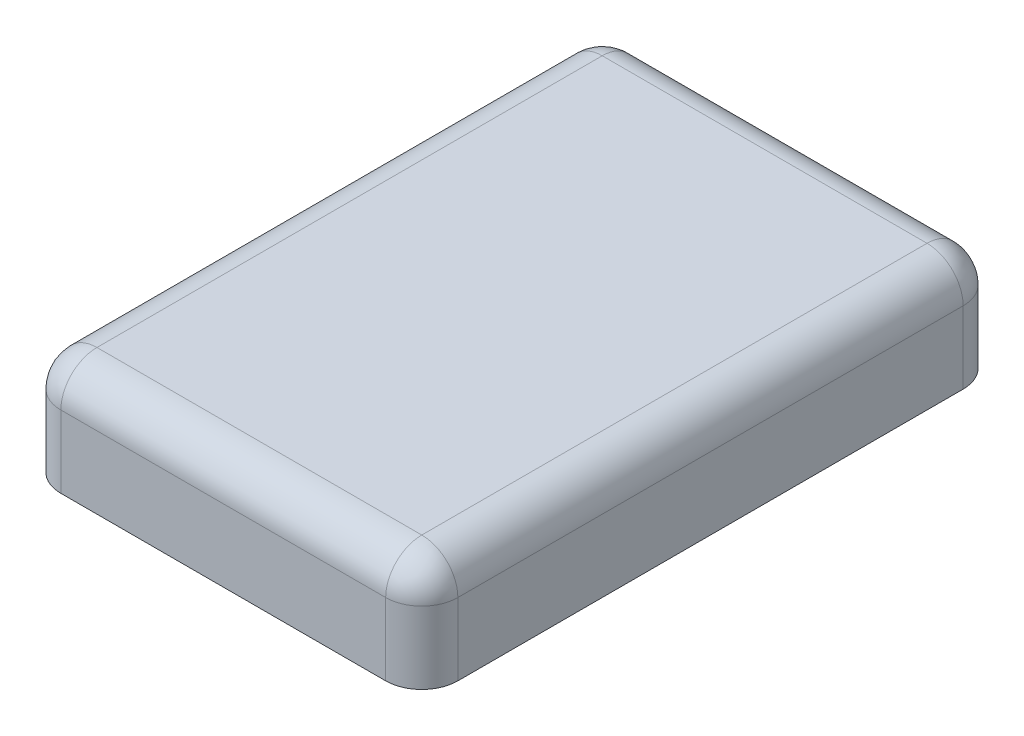
ISO-10303-21;
HEADER;
FILE_DESCRIPTION(('STEP AP214'),'2;1');
FILE_NAME('part.step','',(''),(''),'','','');
FILE_SCHEMA(('AUTOMOTIVE_DESIGN { 1 0 10303 214 1 1 1 1 }'));
ENDSEC;
DATA;
#1=APPLICATION_CONTEXT('core data for automotive mechanical design processes');
#2=APPLICATION_PROTOCOL_DEFINITION('international standard','automotive_design',2000,#1);
#3=PRODUCT_CONTEXT('',#1,'mechanical');
#4=PRODUCT('Part','Part','',(#3));
#5=PRODUCT_RELATED_PRODUCT_CATEGORY('part','',(#4));
#6=PRODUCT_DEFINITION_FORMATION('','',#4);
#7=PRODUCT_DEFINITION_CONTEXT('part definition',#1,'design');
#8=PRODUCT_DEFINITION('design','',#6,#7);
#9=PRODUCT_DEFINITION_SHAPE('','',#8);
#10=(LENGTH_UNIT() NAMED_UNIT(*) SI_UNIT(.MILLI.,.METRE.));
#11=(NAMED_UNIT(*) PLANE_ANGLE_UNIT() SI_UNIT($,.RADIAN.));
#12=(NAMED_UNIT(*) SI_UNIT($,.STERADIAN.) SOLID_ANGLE_UNIT());
#13=UNCERTAINTY_MEASURE_WITH_UNIT(LENGTH_MEASURE(1.E-05),#10,'distance_accuracy_value','');
#14=(GEOMETRIC_REPRESENTATION_CONTEXT(3) GLOBAL_UNCERTAINTY_ASSIGNED_CONTEXT((#13)) GLOBAL_UNIT_ASSIGNED_CONTEXT((#10,
#11,#12)) REPRESENTATION_CONTEXT('',''));
#15=CARTESIAN_POINT('',(0.,0.,0.));
#16=DIRECTION('',(0.,0.,1.));
#17=DIRECTION('',(1.,0.,0.));
#18=AXIS2_PLACEMENT_3D('',#15,#16,#17);
#19=CARTESIAN_POINT('',(0.,0.6,0.));
#20=DIRECTION('',(0.,1.,0.));
#21=DIRECTION('',(0.,0.,1.));
#22=AXIS2_PLACEMENT_3D('',#19,#20,#21);
#23=PLANE('',#22);
#24=DIRECTION('',(-1.,0.,0.));
#25=VECTOR('',#24,1.);
#26=CARTESIAN_POINT('',(0.,0.6,1.4));
#27=LINE('',#26,#25);
#28=CARTESIAN_POINT('',(0.9,0.6,1.4));
#29=VERTEX_POINT('',#28);
#30=CARTESIAN_POINT('',(-0.899999999999808,0.6,1.4));
#31=VERTEX_POINT('',#30);
#32=EDGE_CURVE('E114',#29,#31,#27,.T.);
#33=ORIENTED_EDGE('',*,*,#32,.F.);
#34=DIRECTION('',(0.,0.,1.));
#35=VECTOR('',#34,1.);
#36=CARTESIAN_POINT('',(0.9,0.6,0.));
#37=LINE('',#36,#35);
#38=CARTESIAN_POINT('',(0.9,0.6,-1.4));
#39=VERTEX_POINT('',#38);
#40=EDGE_CURVE('E111',#39,#29,#37,.T.);
#41=ORIENTED_EDGE('',*,*,#40,.F.);
#42=DIRECTION('',(1.,0.,0.));
#43=VECTOR('',#42,1.);
#44=CARTESIAN_POINT('',(0.,0.6,-1.4));
#45=LINE('',#44,#43);
#46=CARTESIAN_POINT('',(-0.900000000000001,0.6,-1.4));
#47=VERTEX_POINT('',#46);
#48=EDGE_CURVE('E100',#47,#39,#45,.T.);
#49=ORIENTED_EDGE('',*,*,#48,.F.);
#50=DIRECTION('',(0.,0.,-1.));
#51=VECTOR('',#50,1.);
#52=CARTESIAN_POINT('',(-0.9,0.6,0.));
#53=LINE('',#52,#51);
#54=EDGE_CURVE('E157',#31,#47,#53,.T.);
#55=ORIENTED_EDGE('',*,*,#54,.F.);
#56=EDGE_LOOP('',(#33,#41,#49,#55));
#57=FACE_BOUND('',#56,.T.);
#58=ADVANCED_FACE('F17',(#57),#23,.T.);
#59=CARTESIAN_POINT('',(0.9,0.4,-1.4));
#60=DIRECTION('',(0.,0.,1.));
#61=DIRECTION('',(0.,-1.,0.));
#62=AXIS2_PLACEMENT_3D('',#59,#60,#61);
#63=SPHERICAL_SURFACE('',#62,0.2);
#64=CARTESIAN_POINT('',(0.9,0.4,-1.4));
#65=DIRECTION('',(0.,-1.,0.));
#66=DIRECTION('',(0.,0.,-1.));
#67=AXIS2_PLACEMENT_3D('',#64,#65,#66);
#68=CIRCLE('',#67,0.2);
#69=CARTESIAN_POINT('',(0.9,0.4,-1.6));
#70=VERTEX_POINT('',#69);
#71=CARTESIAN_POINT('',(1.1,0.4,-1.4));
#72=VERTEX_POINT('',#71);
#73=EDGE_CURVE('E65',#70,#72,#68,.T.);
#74=ORIENTED_EDGE('',*,*,#73,.F.);
#75=CARTESIAN_POINT('',(0.9,0.4,-1.4));
#76=DIRECTION('',(1.,0.,0.));
#77=DIRECTION('',(0.,0.,-1.));
#78=AXIS2_PLACEMENT_3D('',#75,#76,#77);
#79=CIRCLE('',#78,0.2);
#80=EDGE_CURVE('E105',#39,#70,#79,.F.);
#81=ORIENTED_EDGE('',*,*,#80,.F.);
#82=CARTESIAN_POINT('',(0.9,0.4,-1.4));
#83=DIRECTION('',(0.,0.,1.));
#84=DIRECTION('',(1.,0.,0.));
#85=AXIS2_PLACEMENT_3D('',#82,#83,#84);
#86=CIRCLE('',#85,0.2);
#87=EDGE_CURVE('E118',#72,#39,#86,.T.);
#88=ORIENTED_EDGE('',*,*,#87,.F.);
#89=EDGE_LOOP('',(#74,#81,#88));
#90=FACE_BOUND('',#89,.T.);
#91=ADVANCED_FACE('F127',(#90),#63,.T.);
#92=CARTESIAN_POINT('',(0.,0.4,-1.4));
#93=DIRECTION('',(1.,0.,0.));
#94=DIRECTION('',(0.,0.,-1.));
#95=AXIS2_PLACEMENT_3D('',#92,#93,#94);
#96=CYLINDRICAL_SURFACE('',#95,0.2);
#97=CARTESIAN_POINT('',(-0.900000000000001,0.4,-1.4));
#98=DIRECTION('',(-1.,0.,0.));
#99=DIRECTION('',(0.,0.,1.));
#100=AXIS2_PLACEMENT_3D('',#97,#98,#99);
#101=CIRCLE('',#100,0.2);
#102=CARTESIAN_POINT('',(-0.900000000000001,0.4,-1.6));
#103=VERTEX_POINT('',#102);
#104=EDGE_CURVE('E106',#47,#103,#101,.T.);
#105=ORIENTED_EDGE('',*,*,#104,.F.);
#106=ORIENTED_EDGE('',*,*,#48,.T.);
#107=ORIENTED_EDGE('',*,*,#80,.T.);
#108=DIRECTION('',(1.,0.,0.));
#109=VECTOR('',#108,1.);
#110=CARTESIAN_POINT('',(-1.1,0.4,-1.6));
#111=LINE('',#110,#109);
#112=EDGE_CURVE('E172',#70,#103,#111,.F.);
#113=ORIENTED_EDGE('',*,*,#112,.T.);
#114=EDGE_LOOP('',(#105,#106,#107,#113));
#115=FACE_BOUND('',#114,.T.);
#116=ADVANCED_FACE('F102',(#115),#96,.T.);
#117=CARTESIAN_POINT('',(-0.900000000000001,0.4,-1.4));
#118=DIRECTION('',(0.,0.,1.));
#119=DIRECTION('',(0.,-1.,0.));
#120=AXIS2_PLACEMENT_3D('',#117,#118,#119);
#121=SPHERICAL_SURFACE('',#120,0.2);
#122=CARTESIAN_POINT('',(-0.900000000000001,0.4,-1.4));
#123=DIRECTION('',(0.,-1.,0.));
#124=DIRECTION('',(0.,0.,-1.));
#125=AXIS2_PLACEMENT_3D('',#122,#123,#124);
#126=CIRCLE('',#125,0.2);
#127=CARTESIAN_POINT('',(-1.1,0.4,-1.4));
#128=VERTEX_POINT('',#127);
#129=EDGE_CURVE('E169',#128,#103,#126,.T.);
#130=ORIENTED_EDGE('',*,*,#129,.F.);
#131=CARTESIAN_POINT('',(-0.9,0.4,-1.4));
#132=DIRECTION('',(0.,0.,-1.));
#133=DIRECTION('',(-1.,0.,0.));
#134=AXIS2_PLACEMENT_3D('',#131,#132,#133);
#135=CIRCLE('',#134,0.2);
#136=EDGE_CURVE('E153',#47,#128,#135,.F.);
#137=ORIENTED_EDGE('',*,*,#136,.F.);
#138=ORIENTED_EDGE('',*,*,#104,.T.);
#139=EDGE_LOOP('',(#130,#137,#138));
#140=FACE_BOUND('',#139,.T.);
#141=ADVANCED_FACE('F142',(#140),#121,.T.);
#142=CARTESIAN_POINT('',(-0.9,0.4,0.));
#143=DIRECTION('',(0.,0.,-1.));
#144=DIRECTION('',(-1.,0.,0.));
#145=AXIS2_PLACEMENT_3D('',#142,#143,#144);
#146=CYLINDRICAL_SURFACE('',#145,0.2);
#147=CARTESIAN_POINT('',(-0.9,0.4,1.4));
#148=DIRECTION('',(0.,0.,1.));
#149=DIRECTION('',(0.,-1.,0.));
#150=AXIS2_PLACEMENT_3D('',#147,#148,#149);
#151=CIRCLE('',#150,0.2);
#152=CARTESIAN_POINT('',(-1.1,0.4,1.4));
#153=VERTEX_POINT('',#152);
#154=EDGE_CURVE('E161',#31,#153,#151,.T.);
#155=ORIENTED_EDGE('',*,*,#154,.F.);
#156=ORIENTED_EDGE('',*,*,#54,.T.);
#157=ORIENTED_EDGE('',*,*,#136,.T.);
#158=DIRECTION('',(0.,0.,-1.));
#159=VECTOR('',#158,1.);
#160=CARTESIAN_POINT('',(-1.1,0.4,-1.6));
#161=LINE('',#160,#159);
#162=EDGE_CURVE('E282',#128,#153,#161,.F.);
#163=ORIENTED_EDGE('',*,*,#162,.T.);
#164=EDGE_LOOP('',(#155,#156,#157,#163));
#165=FACE_BOUND('',#164,.T.);
#166=ADVANCED_FACE('F146',(#165),#146,.T.);
#167=CARTESIAN_POINT('',(-0.9,0.4,1.4));
#168=DIRECTION('',(0.,0.,1.));
#169=DIRECTION('',(0.,-1.,0.));
#170=AXIS2_PLACEMENT_3D('',#167,#168,#169);
#171=SPHERICAL_SURFACE('',#170,0.2);
#172=CARTESIAN_POINT('',(-0.9,0.4,1.4));
#173=DIRECTION('',(0.,-1.,0.));
#174=DIRECTION('',(0.,0.,-1.));
#175=AXIS2_PLACEMENT_3D('',#172,#173,#174);
#176=CIRCLE('',#175,0.2);
#177=CARTESIAN_POINT('',(-0.9,0.4,1.6));
#178=VERTEX_POINT('',#177);
#179=EDGE_CURVE('E277',#178,#153,#176,.T.);
#180=ORIENTED_EDGE('',*,*,#179,.F.);
#181=CARTESIAN_POINT('',(-0.9,0.4,1.4));
#182=DIRECTION('',(-1.,0.,0.));
#183=DIRECTION('',(0.,0.,1.));
#184=AXIS2_PLACEMENT_3D('',#181,#182,#183);
#185=CIRCLE('',#184,0.2);
#186=EDGE_CURVE('E232',#31,#178,#185,.F.);
#187=ORIENTED_EDGE('',*,*,#186,.F.);
#188=ORIENTED_EDGE('',*,*,#154,.T.);
#189=EDGE_LOOP('',(#180,#187,#188));
#190=FACE_BOUND('',#189,.T.);
#191=ADVANCED_FACE('F219',(#190),#171,.T.);
#192=CARTESIAN_POINT('',(0.,0.4,1.4));
#193=DIRECTION('',(-1.,0.,0.));
#194=DIRECTION('',(0.,0.,1.));
#195=AXIS2_PLACEMENT_3D('',#192,#193,#194);
#196=CYLINDRICAL_SURFACE('',#195,0.2);
#197=ORIENTED_EDGE('',*,*,#186,.T.);
#198=DIRECTION('',(-1.,0.,0.));
#199=VECTOR('',#198,1.);
#200=CARTESIAN_POINT('',(-1.1,0.4,1.6));
#201=LINE('',#200,#199);
#202=CARTESIAN_POINT('',(0.9,0.4,1.6));
#203=VERTEX_POINT('',#202);
#204=EDGE_CURVE('E199',#178,#203,#201,.F.);
#205=ORIENTED_EDGE('',*,*,#204,.T.);
#206=CARTESIAN_POINT('',(0.9,0.4,1.4));
#207=DIRECTION('',(-1.,0.,0.));
#208=DIRECTION('',(0.,0.,1.));
#209=AXIS2_PLACEMENT_3D('',#206,#207,#208);
#210=CIRCLE('',#209,0.2);
#211=EDGE_CURVE('E125',#29,#203,#210,.F.);
#212=ORIENTED_EDGE('',*,*,#211,.F.);
#213=ORIENTED_EDGE('',*,*,#32,.T.);
#214=EDGE_LOOP('',(#197,#205,#212,#213));
#215=FACE_BOUND('',#214,.T.);
#216=ADVANCED_FACE('F215',(#215),#196,.T.);
#217=CARTESIAN_POINT('',(0.9,0.4,1.4));
#218=DIRECTION('',(0.,0.,1.));
#219=DIRECTION('',(0.,-1.,0.));
#220=AXIS2_PLACEMENT_3D('',#217,#218,#219);
#221=SPHERICAL_SURFACE('',#220,0.2);
#222=CARTESIAN_POINT('',(0.9,0.4,1.4));
#223=DIRECTION('',(0.,0.,1.));
#224=DIRECTION('',(1.,0.,0.));
#225=AXIS2_PLACEMENT_3D('',#222,#223,#224);
#226=CIRCLE('',#225,0.2);
#227=CARTESIAN_POINT('',(1.1,0.4,1.4));
#228=VERTEX_POINT('',#227);
#229=EDGE_CURVE('E117',#29,#228,#226,.F.);
#230=ORIENTED_EDGE('',*,*,#229,.F.);
#231=ORIENTED_EDGE('',*,*,#211,.T.);
#232=CARTESIAN_POINT('',(0.9,0.4,1.4));
#233=DIRECTION('',(0.,-1.,0.));
#234=DIRECTION('',(0.,0.,-1.));
#235=AXIS2_PLACEMENT_3D('',#232,#233,#234);
#236=CIRCLE('',#235,0.2);
#237=EDGE_CURVE('E195',#228,#203,#236,.T.);
#238=ORIENTED_EDGE('',*,*,#237,.F.);
#239=EDGE_LOOP('',(#230,#231,#238));
#240=FACE_BOUND('',#239,.T.);
#241=ADVANCED_FACE('F211',(#240),#221,.T.);
#242=CARTESIAN_POINT('',(0.9,0.4,0.));
#243=DIRECTION('',(0.,0.,1.));
#244=DIRECTION('',(1.,0.,0.));
#245=AXIS2_PLACEMENT_3D('',#242,#243,#244);
#246=CYLINDRICAL_SURFACE('',#245,0.2);
#247=ORIENTED_EDGE('',*,*,#229,.T.);
#248=DIRECTION('',(0.,0.,1.));
#249=VECTOR('',#248,1.);
#250=CARTESIAN_POINT('',(1.1,0.4,-1.6));
#251=LINE('',#250,#249);
#252=EDGE_CURVE('E122',#228,#72,#251,.F.);
#253=ORIENTED_EDGE('',*,*,#252,.T.);
#254=ORIENTED_EDGE('',*,*,#87,.T.);
#255=ORIENTED_EDGE('',*,*,#40,.T.);
#256=EDGE_LOOP('',(#247,#253,#254,#255));
#257=FACE_BOUND('',#256,.T.);
#258=ADVANCED_FACE('F121',(#257),#246,.T.);
#259=CARTESIAN_POINT('',(0.9,0.6,-1.4));
#260=DIRECTION('',(0.,-1.,0.));
#261=DIRECTION('',(0.,0.,-1.));
#262=AXIS2_PLACEMENT_3D('',#259,#260,#261);
#263=CYLINDRICAL_SURFACE('',#262,0.2);
#264=DIRECTION('',(0.,1.,0.));
#265=VECTOR('',#264,1.);
#266=CARTESIAN_POINT('',(1.1,0.6,-1.4));
#267=LINE('',#266,#265);
#268=CARTESIAN_POINT('',(1.1,0.,-1.4));
#269=VERTEX_POINT('',#268);
#270=EDGE_CURVE('E187',#72,#269,#267,.F.);
#271=ORIENTED_EDGE('',*,*,#270,.T.);
#272=CARTESIAN_POINT('',(0.9,0.,-1.4));
#273=DIRECTION('',(0.,-1.,0.));
#274=DIRECTION('',(0.,0.,-1.));
#275=AXIS2_PLACEMENT_3D('',#272,#273,#274);
#276=CIRCLE('',#275,0.2);
#277=CARTESIAN_POINT('',(0.9,0.,-1.6));
#278=VERTEX_POINT('',#277);
#279=EDGE_CURVE('E20',#269,#278,#276,.F.);
#280=ORIENTED_EDGE('',*,*,#279,.T.);
#281=DIRECTION('',(0.,1.,0.));
#282=VECTOR('',#281,1.);
#283=CARTESIAN_POINT('',(0.9,0.6,-1.6));
#284=LINE('',#283,#282);
#285=EDGE_CURVE('E174',#278,#70,#284,.T.);
#286=ORIENTED_EDGE('',*,*,#285,.T.);
#287=ORIENTED_EDGE('',*,*,#73,.T.);
#288=EDGE_LOOP('',(#271,#280,#286,#287));
#289=FACE_BOUND('',#288,.T.);
#290=ADVANCED_FACE('F378',(#289),#263,.T.);
#291=CARTESIAN_POINT('',(-1.1,0.6,-1.6));
#292=DIRECTION('',(0.,0.,1.));
#293=DIRECTION('',(1.,0.,0.));
#294=AXIS2_PLACEMENT_3D('',#291,#292,#293);
#295=PLANE('',#294);
#296=ORIENTED_EDGE('',*,*,#112,.F.);
#297=ORIENTED_EDGE('',*,*,#285,.F.);
#298=DIRECTION('',(1.,0.,0.));
#299=VECTOR('',#298,1.);
#300=CARTESIAN_POINT('',(0.,0.,-1.6));
#301=LINE('',#300,#299);
#302=CARTESIAN_POINT('',(-0.900000000000001,0.,-1.6));
#303=VERTEX_POINT('',#302);
#304=EDGE_CURVE('E251',#278,#303,#301,.F.);
#305=ORIENTED_EDGE('',*,*,#304,.T.);
#306=DIRECTION('',(0.,-1.,0.));
#307=VECTOR('',#306,1.);
#308=CARTESIAN_POINT('',(-0.900000000000001,0.6,-1.6));
#309=LINE('',#308,#307);
#310=EDGE_CURVE('E171',#103,#303,#309,.T.);
#311=ORIENTED_EDGE('',*,*,#310,.F.);
#312=EDGE_LOOP('',(#296,#297,#305,#311));
#313=FACE_BOUND('',#312,.T.);
#314=ADVANCED_FACE('F369',(#313),#295,.F.);
#315=CARTESIAN_POINT('',(-0.900000000000001,0.6,-1.4));
#316=DIRECTION('',(0.,-1.,0.));
#317=DIRECTION('',(0.,0.,-1.));
#318=AXIS2_PLACEMENT_3D('',#315,#316,#317);
#319=CYLINDRICAL_SURFACE('',#318,0.2);
#320=ORIENTED_EDGE('',*,*,#310,.T.);
#321=CARTESIAN_POINT('',(-0.900000000000001,0.,-1.4));
#322=DIRECTION('',(0.,-1.,0.));
#323=DIRECTION('',(0.,0.,-1.));
#324=AXIS2_PLACEMENT_3D('',#321,#322,#323);
#325=CIRCLE('',#324,0.2);
#326=CARTESIAN_POINT('',(-1.1,0.,-1.4));
#327=VERTEX_POINT('',#326);
#328=EDGE_CURVE('E249',#303,#327,#325,.F.);
#329=ORIENTED_EDGE('',*,*,#328,.T.);
#330=DIRECTION('',(0.,1.,0.));
#331=VECTOR('',#330,1.);
#332=CARTESIAN_POINT('',(-1.1,0.6,-1.4));
#333=LINE('',#332,#331);
#334=EDGE_CURVE('E280',#327,#128,#333,.T.);
#335=ORIENTED_EDGE('',*,*,#334,.T.);
#336=ORIENTED_EDGE('',*,*,#129,.T.);
#337=EDGE_LOOP('',(#320,#329,#335,#336));
#338=FACE_BOUND('',#337,.T.);
#339=ADVANCED_FACE('F284',(#338),#319,.T.);
#340=CARTESIAN_POINT('',(-1.1,0.6,-1.6));
#341=DIRECTION('',(1.,0.,0.));
#342=DIRECTION('',(0.,0.,-1.));
#343=AXIS2_PLACEMENT_3D('',#340,#341,#342);
#344=PLANE('',#343);
#345=ORIENTED_EDGE('',*,*,#162,.F.);
#346=ORIENTED_EDGE('',*,*,#334,.F.);
#347=DIRECTION('',(0.,0.,1.));
#348=VECTOR('',#347,1.);
#349=CARTESIAN_POINT('',(-1.1,0.,0.));
#350=LINE('',#349,#348);
#351=CARTESIAN_POINT('',(-1.1,0.,1.4));
#352=VERTEX_POINT('',#351);
#353=EDGE_CURVE('E248',#327,#352,#350,.T.);
#354=ORIENTED_EDGE('',*,*,#353,.T.);
#355=DIRECTION('',(0.,-1.,0.));
#356=VECTOR('',#355,1.);
#357=CARTESIAN_POINT('',(-1.1,0.6,1.4));
#358=LINE('',#357,#356);
#359=EDGE_CURVE('E273',#153,#352,#358,.T.);
#360=ORIENTED_EDGE('',*,*,#359,.F.);
#361=EDGE_LOOP('',(#345,#346,#354,#360));
#362=FACE_BOUND('',#361,.T.);
#363=ADVANCED_FACE('F293',(#362),#344,.F.);
#364=CARTESIAN_POINT('',(-0.9,0.6,1.4));
#365=DIRECTION('',(0.,-1.,0.));
#366=DIRECTION('',(0.,0.,-1.));
#367=AXIS2_PLACEMENT_3D('',#364,#365,#366);
#368=CYLINDRICAL_SURFACE('',#367,0.2);
#369=ORIENTED_EDGE('',*,*,#359,.T.);
#370=CARTESIAN_POINT('',(-0.9,0.,1.4));
#371=DIRECTION('',(0.,-1.,0.));
#372=DIRECTION('',(0.,0.,-1.));
#373=AXIS2_PLACEMENT_3D('',#370,#371,#372);
#374=CIRCLE('',#373,0.2);
#375=CARTESIAN_POINT('',(-0.9,0.,1.6));
#376=VERTEX_POINT('',#375);
#377=EDGE_CURVE('E246',#352,#376,#374,.F.);
#378=ORIENTED_EDGE('',*,*,#377,.T.);
#379=DIRECTION('',(0.,1.,0.));
#380=VECTOR('',#379,1.);
#381=CARTESIAN_POINT('',(-0.9,0.6,1.6));
#382=LINE('',#381,#380);
#383=EDGE_CURVE('E204',#376,#178,#382,.T.);
#384=ORIENTED_EDGE('',*,*,#383,.T.);
#385=ORIENTED_EDGE('',*,*,#179,.T.);
#386=EDGE_LOOP('',(#369,#378,#384,#385));
#387=FACE_BOUND('',#386,.T.);
#388=ADVANCED_FACE('F301',(#387),#368,.T.);
#389=CARTESIAN_POINT('',(-1.1,0.6,1.6));
#390=DIRECTION('',(0.,0.,-1.));
#391=DIRECTION('',(-1.,0.,0.));
#392=AXIS2_PLACEMENT_3D('',#389,#390,#391);
#393=PLANE('',#392);
#394=ORIENTED_EDGE('',*,*,#204,.F.);
#395=ORIENTED_EDGE('',*,*,#383,.F.);
#396=DIRECTION('',(1.,0.,0.));
#397=VECTOR('',#396,1.);
#398=CARTESIAN_POINT('',(0.,0.,1.6));
#399=LINE('',#398,#397);
#400=CARTESIAN_POINT('',(0.9,0.,1.6));
#401=VERTEX_POINT('',#400);
#402=EDGE_CURVE('E245',#376,#401,#399,.T.);
#403=ORIENTED_EDGE('',*,*,#402,.T.);
#404=DIRECTION('',(0.,-1.,0.));
#405=VECTOR('',#404,1.);
#406=CARTESIAN_POINT('',(0.9,0.6,1.6));
#407=LINE('',#406,#405);
#408=EDGE_CURVE('E198',#203,#401,#407,.T.);
#409=ORIENTED_EDGE('',*,*,#408,.F.);
#410=EDGE_LOOP('',(#394,#395,#403,#409));
#411=FACE_BOUND('',#410,.T.);
#412=ADVANCED_FACE('F305',(#411),#393,.F.);
#413=CARTESIAN_POINT('',(0.9,0.6,1.4));
#414=DIRECTION('',(0.,-1.,0.));
#415=DIRECTION('',(0.,0.,-1.));
#416=AXIS2_PLACEMENT_3D('',#413,#414,#415);
#417=CYLINDRICAL_SURFACE('',#416,0.2);
#418=ORIENTED_EDGE('',*,*,#408,.T.);
#419=CARTESIAN_POINT('',(0.9,0.,1.4));
#420=DIRECTION('',(0.,-1.,0.));
#421=DIRECTION('',(0.,0.,-1.));
#422=AXIS2_PLACEMENT_3D('',#419,#420,#421);
#423=CIRCLE('',#422,0.2);
#424=CARTESIAN_POINT('',(1.1,0.,1.4));
#425=VERTEX_POINT('',#424);
#426=EDGE_CURVE('E26',#401,#425,#423,.F.);
#427=ORIENTED_EDGE('',*,*,#426,.T.);
#428=DIRECTION('',(0.,1.,0.));
#429=VECTOR('',#428,1.);
#430=CARTESIAN_POINT('',(1.1,0.6,1.4));
#431=LINE('',#430,#429);
#432=EDGE_CURVE('E34',#425,#228,#431,.T.);
#433=ORIENTED_EDGE('',*,*,#432,.T.);
#434=ORIENTED_EDGE('',*,*,#237,.T.);
#435=EDGE_LOOP('',(#418,#427,#433,#434));
#436=FACE_BOUND('',#435,.T.);
#437=ADVANCED_FACE('F311',(#436),#417,.T.);
#438=CARTESIAN_POINT('',(1.1,0.6,-1.6));
#439=DIRECTION('',(-1.,0.,0.));
#440=DIRECTION('',(0.,0.,1.));
#441=AXIS2_PLACEMENT_3D('',#438,#439,#440);
#442=PLANE('',#441);
#443=ORIENTED_EDGE('',*,*,#252,.F.);
#444=ORIENTED_EDGE('',*,*,#432,.F.);
#445=DIRECTION('',(0.,0.,1.));
#446=VECTOR('',#445,1.);
#447=CARTESIAN_POINT('',(1.1,0.,0.));
#448=LINE('',#447,#446);
#449=EDGE_CURVE('E11',#425,#269,#448,.F.);
#450=ORIENTED_EDGE('',*,*,#449,.T.);
#451=ORIENTED_EDGE('',*,*,#270,.F.);
#452=EDGE_LOOP('',(#443,#444,#450,#451));
#453=FACE_BOUND('',#452,.T.);
#454=ADVANCED_FACE('F310',(#453),#442,.F.);
#455=CARTESIAN_POINT('',(0.,0.,0.));
#456=DIRECTION('',(0.,1.,0.));
#457=DIRECTION('',(0.,0.,1.));
#458=AXIS2_PLACEMENT_3D('',#455,#456,#457);
#459=PLANE('',#458);
#460=ORIENTED_EDGE('',*,*,#426,.F.);
#461=ORIENTED_EDGE('',*,*,#402,.F.);
#462=ORIENTED_EDGE('',*,*,#377,.F.);
#463=ORIENTED_EDGE('',*,*,#353,.F.);
#464=ORIENTED_EDGE('',*,*,#328,.F.);
#465=ORIENTED_EDGE('',*,*,#304,.F.);
#466=ORIENTED_EDGE('',*,*,#279,.F.);
#467=ORIENTED_EDGE('',*,*,#449,.F.);
#468=EDGE_LOOP('',(#460,#461,#462,#463,#464,#465,#466,#467));
#469=FACE_BOUND('',#468,.T.);
#470=ADVANCED_FACE('F287',(#469),#459,.F.);
#471=CLOSED_SHELL('',(#58,#91,#116,#141,#166,#191,#216,#241,#258,#290,#314,#339,#363,#388,#412,
#437,#454,#470));
#472=MANIFOLD_SOLID_BREP('B1',#471);
#473=ADVANCED_BREP_SHAPE_REPRESENTATION('',(#18,#472),#14);
#474=SHAPE_DEFINITION_REPRESENTATION(#9,#473);
ENDSEC;
END-ISO-10303-21;
